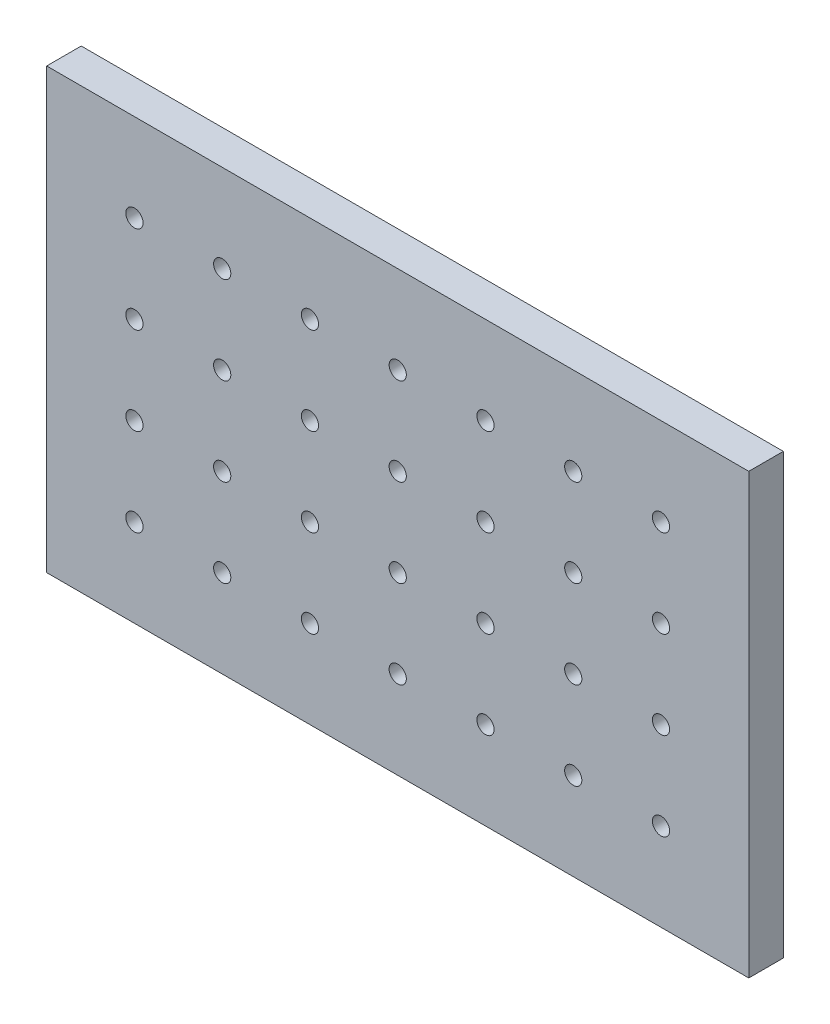
ISO-10303-21;
HEADER;
FILE_DESCRIPTION(('STEP AP214'),'2;1');
FILE_NAME('part.step','',(''),(''),'','','');
FILE_SCHEMA(('AUTOMOTIVE_DESIGN { 1 0 10303 214 1 1 1 1 }'));
ENDSEC;
DATA;
#1=APPLICATION_CONTEXT('core data for automotive mechanical design processes');
#2=APPLICATION_PROTOCOL_DEFINITION('international standard','automotive_design',2000,#1);
#3=PRODUCT_CONTEXT('',#1,'mechanical');
#4=PRODUCT('Part','Part','',(#3));
#5=PRODUCT_RELATED_PRODUCT_CATEGORY('part','',(#4));
#6=PRODUCT_DEFINITION_FORMATION('','',#4);
#7=PRODUCT_DEFINITION_CONTEXT('part definition',#1,'design');
#8=PRODUCT_DEFINITION('design','',#6,#7);
#9=PRODUCT_DEFINITION_SHAPE('','',#8);
#10=(LENGTH_UNIT() NAMED_UNIT(*) SI_UNIT(.MILLI.,.METRE.));
#11=(NAMED_UNIT(*) PLANE_ANGLE_UNIT() SI_UNIT($,.RADIAN.));
#12=(NAMED_UNIT(*) SI_UNIT($,.STERADIAN.) SOLID_ANGLE_UNIT());
#13=UNCERTAINTY_MEASURE_WITH_UNIT(LENGTH_MEASURE(1.E-05),#10,'distance_accuracy_value','');
#14=(GEOMETRIC_REPRESENTATION_CONTEXT(3) GLOBAL_UNCERTAINTY_ASSIGNED_CONTEXT((#13)) GLOBAL_UNIT_ASSIGNED_CONTEXT((#10,
#11,#12)) REPRESENTATION_CONTEXT('',''));
#15=CARTESIAN_POINT('',(0.,0.,0.));
#16=DIRECTION('',(0.,0.,1.));
#17=DIRECTION('',(1.,0.,0.));
#18=AXIS2_PLACEMENT_3D('',#15,#16,#17);
#19=CARTESIAN_POINT('',(0.,0.,10.));
#20=DIRECTION('',(-1.,0.,0.));
#21=DIRECTION('',(0.,-1.,0.));
#22=AXIS2_PLACEMENT_3D('',#19,#20,#21);
#23=PLANE('',#22);
#24=DIRECTION('',(0.,1.,0.));
#25=VECTOR('',#24,1.);
#26=CARTESIAN_POINT('',(0.,0.,0.));
#27=LINE('',#26,#25);
#28=CARTESIAN_POINT('',(0.,-127.,0.));
#29=VERTEX_POINT('',#28);
#30=CARTESIAN_POINT('',(0.,0.,0.));
#31=VERTEX_POINT('',#30);
#32=EDGE_CURVE('E97',#29,#31,#27,.T.);
#33=ORIENTED_EDGE('',*,*,#32,.T.);
#34=DIRECTION('',(0.,0.,-1.));
#35=VECTOR('',#34,1.);
#36=CARTESIAN_POINT('',(0.,0.,10.));
#37=LINE('',#36,#35);
#38=CARTESIAN_POINT('',(0.,0.,10.));
#39=VERTEX_POINT('',#38);
#40=EDGE_CURVE('E11',#39,#31,#37,.T.);
#41=ORIENTED_EDGE('',*,*,#40,.F.);
#42=DIRECTION('',(0.,1.,0.));
#43=VECTOR('',#42,1.);
#44=CARTESIAN_POINT('',(0.,0.,10.));
#45=LINE('',#44,#43);
#46=CARTESIAN_POINT('',(0.,-127.,10.));
#47=VERTEX_POINT('',#46);
#48=EDGE_CURVE('E85',#47,#39,#45,.T.);
#49=ORIENTED_EDGE('',*,*,#48,.F.);
#50=DIRECTION('',(0.,0.,-1.));
#51=VECTOR('',#50,1.);
#52=CARTESIAN_POINT('',(0.,-127.,10.));
#53=LINE('',#52,#51);
#54=EDGE_CURVE('E93',#47,#29,#53,.T.);
#55=ORIENTED_EDGE('',*,*,#54,.T.);
#56=EDGE_LOOP('',(#33,#41,#49,#55));
#57=FACE_BOUND('',#56,.T.);
#58=ADVANCED_FACE('F34',(#57),#23,.F.);
#59=CARTESIAN_POINT('',(0.,0.,10.));
#60=DIRECTION('',(0.,-1.,0.));
#61=DIRECTION('',(1.,0.,0.));
#62=AXIS2_PLACEMENT_3D('',#59,#60,#61);
#63=PLANE('',#62);
#64=DIRECTION('',(-1.,0.,0.));
#65=VECTOR('',#64,1.);
#66=CARTESIAN_POINT('',(0.,0.,0.));
#67=LINE('',#66,#65);
#68=CARTESIAN_POINT('',(-203.2,0.,0.));
#69=VERTEX_POINT('',#68);
#70=EDGE_CURVE('E89',#31,#69,#67,.T.);
#71=ORIENTED_EDGE('',*,*,#70,.T.);
#72=DIRECTION('',(0.,0.,-1.));
#73=VECTOR('',#72,1.);
#74=CARTESIAN_POINT('',(-203.2,0.,10.));
#75=LINE('',#74,#73);
#76=CARTESIAN_POINT('',(-203.2,0.,10.));
#77=VERTEX_POINT('',#76);
#78=EDGE_CURVE('E42',#77,#69,#75,.T.);
#79=ORIENTED_EDGE('',*,*,#78,.F.);
#80=DIRECTION('',(-1.,0.,0.));
#81=VECTOR('',#80,1.);
#82=CARTESIAN_POINT('',(0.,0.,10.));
#83=LINE('',#82,#81);
#84=EDGE_CURVE('E80',#39,#77,#83,.T.);
#85=ORIENTED_EDGE('',*,*,#84,.F.);
#86=ORIENTED_EDGE('',*,*,#40,.T.);
#87=EDGE_LOOP('',(#71,#79,#85,#86));
#88=FACE_BOUND('',#87,.T.);
#89=ADVANCED_FACE('F88',(#88),#63,.F.);
#90=CARTESIAN_POINT('',(-203.2,0.,10.));
#91=DIRECTION('',(1.,0.,0.));
#92=DIRECTION('',(0.,1.,0.));
#93=AXIS2_PLACEMENT_3D('',#90,#91,#92);
#94=PLANE('',#93);
#95=DIRECTION('',(0.,-1.,0.));
#96=VECTOR('',#95,1.);
#97=CARTESIAN_POINT('',(-203.2,0.,0.));
#98=LINE('',#97,#96);
#99=CARTESIAN_POINT('',(-203.2,-127.,0.));
#100=VERTEX_POINT('',#99);
#101=EDGE_CURVE('E67',#69,#100,#98,.T.);
#102=ORIENTED_EDGE('',*,*,#101,.T.);
#103=DIRECTION('',(0.,0.,-1.));
#104=VECTOR('',#103,1.);
#105=CARTESIAN_POINT('',(-203.2,-127.,10.));
#106=LINE('',#105,#104);
#107=CARTESIAN_POINT('',(-203.2,-127.,10.));
#108=VERTEX_POINT('',#107);
#109=EDGE_CURVE('E90',#108,#100,#106,.T.);
#110=ORIENTED_EDGE('',*,*,#109,.F.);
#111=DIRECTION('',(0.,-1.,0.));
#112=VECTOR('',#111,1.);
#113=CARTESIAN_POINT('',(-203.2,0.,10.));
#114=LINE('',#113,#112);
#115=EDGE_CURVE('E83',#77,#108,#114,.T.);
#116=ORIENTED_EDGE('',*,*,#115,.F.);
#117=ORIENTED_EDGE('',*,*,#78,.T.);
#118=EDGE_LOOP('',(#102,#110,#116,#117));
#119=FACE_BOUND('',#118,.T.);
#120=ADVANCED_FACE('F91',(#119),#94,.F.);
#121=CARTESIAN_POINT('',(0.,-127.,10.));
#122=DIRECTION('',(0.,1.,0.));
#123=DIRECTION('',(-1.,0.,0.));
#124=AXIS2_PLACEMENT_3D('',#121,#122,#123);
#125=PLANE('',#124);
#126=DIRECTION('',(1.,0.,0.));
#127=VECTOR('',#126,1.);
#128=CARTESIAN_POINT('',(0.,-127.,0.));
#129=LINE('',#128,#127);
#130=EDGE_CURVE('E73',#100,#29,#129,.T.);
#131=ORIENTED_EDGE('',*,*,#130,.T.);
#132=ORIENTED_EDGE('',*,*,#54,.F.);
#133=DIRECTION('',(1.,0.,0.));
#134=VECTOR('',#133,1.);
#135=CARTESIAN_POINT('',(0.,-127.,10.));
#136=LINE('',#135,#134);
#137=EDGE_CURVE('E50',#108,#47,#136,.T.);
#138=ORIENTED_EDGE('',*,*,#137,.F.);
#139=ORIENTED_EDGE('',*,*,#109,.T.);
#140=EDGE_LOOP('',(#131,#132,#138,#139));
#141=FACE_BOUND('',#140,.T.);
#142=ADVANCED_FACE('F105',(#141),#125,.F.);
#143=CARTESIAN_POINT('',(0.,0.,10.));
#144=DIRECTION('',(0.,0.,-1.));
#145=DIRECTION('',(-1.,0.,0.));
#146=AXIS2_PLACEMENT_3D('',#143,#144,#145);
#147=PLANE('',#146);
#148=CARTESIAN_POINT('',(-177.799999999999,-101.6,10.));
#149=DIRECTION('',(0.,0.,1.));
#150=DIRECTION('',(1.,0.,0.));
#151=AXIS2_PLACEMENT_3D('',#148,#149,#150);
#152=CIRCLE('',#151,2.48999999999999);
#153=CARTESIAN_POINT('',(-175.309999999999,-101.6,10.));
#154=VERTEX_POINT('',#153);
#155=EDGE_CURVE('E270',#154,#154,#152,.T.);
#156=ORIENTED_EDGE('',*,*,#155,.F.);
#157=EDGE_LOOP('',(#156));
#158=FACE_BOUND('',#157,.T.);
#159=CARTESIAN_POINT('',(-177.799999999999,-76.2,10.));
#160=DIRECTION('',(0.,0.,1.));
#161=DIRECTION('',(1.,0.,0.));
#162=AXIS2_PLACEMENT_3D('',#159,#160,#161);
#163=CIRCLE('',#162,2.48999999999999);
#164=CARTESIAN_POINT('',(-175.309999999999,-76.2,10.));
#165=VERTEX_POINT('',#164);
#166=EDGE_CURVE('E264',#165,#165,#163,.T.);
#167=ORIENTED_EDGE('',*,*,#166,.F.);
#168=EDGE_LOOP('',(#167));
#169=FACE_BOUND('',#168,.T.);
#170=CARTESIAN_POINT('',(-177.8,-50.8,10.));
#171=DIRECTION('',(0.,0.,1.));
#172=DIRECTION('',(1.,0.,0.));
#173=AXIS2_PLACEMENT_3D('',#170,#171,#172);
#174=CIRCLE('',#173,2.48999999999999);
#175=CARTESIAN_POINT('',(-175.31,-50.8,10.));
#176=VERTEX_POINT('',#175);
#177=EDGE_CURVE('E258',#176,#176,#174,.T.);
#178=ORIENTED_EDGE('',*,*,#177,.F.);
#179=EDGE_LOOP('',(#178));
#180=FACE_BOUND('',#179,.T.);
#181=CARTESIAN_POINT('',(-25.3999999999993,-101.6,10.));
#182=DIRECTION('',(0.,0.,1.));
#183=DIRECTION('',(1.,0.,0.));
#184=AXIS2_PLACEMENT_3D('',#181,#182,#183);
#185=CIRCLE('',#184,2.49);
#186=CARTESIAN_POINT('',(-22.9099999999993,-101.6,10.));
#187=VERTEX_POINT('',#186);
#188=EDGE_CURVE('E252',#187,#187,#185,.T.);
#189=ORIENTED_EDGE('',*,*,#188,.F.);
#190=EDGE_LOOP('',(#189));
#191=FACE_BOUND('',#190,.T.);
#192=CARTESIAN_POINT('',(-50.7999999999993,-101.6,10.));
#193=DIRECTION('',(0.,0.,1.));
#194=DIRECTION('',(1.,0.,0.));
#195=AXIS2_PLACEMENT_3D('',#192,#193,#194);
#196=CIRCLE('',#195,2.49);
#197=CARTESIAN_POINT('',(-48.3099999999993,-101.6,10.));
#198=VERTEX_POINT('',#197);
#199=EDGE_CURVE('E246',#198,#198,#196,.T.);
#200=ORIENTED_EDGE('',*,*,#199,.F.);
#201=EDGE_LOOP('',(#200));
#202=FACE_BOUND('',#201,.T.);
#203=CARTESIAN_POINT('',(-76.1999999999993,-101.6,10.));
#204=DIRECTION('',(0.,0.,1.));
#205=DIRECTION('',(1.,0.,0.));
#206=AXIS2_PLACEMENT_3D('',#203,#204,#205);
#207=CIRCLE('',#206,2.49000000000001);
#208=CARTESIAN_POINT('',(-73.7099999999993,-101.6,10.));
#209=VERTEX_POINT('',#208);
#210=EDGE_CURVE('E240',#209,#209,#207,.T.);
#211=ORIENTED_EDGE('',*,*,#210,.F.);
#212=EDGE_LOOP('',(#211));
#213=FACE_BOUND('',#212,.T.);
#214=CARTESIAN_POINT('',(-101.599999999999,-101.6,10.));
#215=DIRECTION('',(0.,0.,1.));
#216=DIRECTION('',(1.,0.,0.));
#217=AXIS2_PLACEMENT_3D('',#214,#215,#216);
#218=CIRCLE('',#217,2.49000000000001);
#219=CARTESIAN_POINT('',(-99.1099999999993,-101.6,10.));
#220=VERTEX_POINT('',#219);
#221=EDGE_CURVE('E234',#220,#220,#218,.T.);
#222=ORIENTED_EDGE('',*,*,#221,.F.);
#223=EDGE_LOOP('',(#222));
#224=FACE_BOUND('',#223,.T.);
#225=CARTESIAN_POINT('',(-126.999999999999,-101.6,10.));
#226=DIRECTION('',(0.,0.,1.));
#227=DIRECTION('',(1.,0.,0.));
#228=AXIS2_PLACEMENT_3D('',#225,#226,#227);
#229=CIRCLE('',#228,2.49000000000001);
#230=CARTESIAN_POINT('',(-124.509999999999,-101.6,10.));
#231=VERTEX_POINT('',#230);
#232=EDGE_CURVE('E228',#231,#231,#229,.T.);
#233=ORIENTED_EDGE('',*,*,#232,.F.);
#234=EDGE_LOOP('',(#233));
#235=FACE_BOUND('',#234,.T.);
#236=CARTESIAN_POINT('',(-152.399999999999,-101.6,10.));
#237=DIRECTION('',(0.,0.,1.));
#238=DIRECTION('',(1.,0.,0.));
#239=AXIS2_PLACEMENT_3D('',#236,#237,#238);
#240=CIRCLE('',#239,2.48999999999999);
#241=CARTESIAN_POINT('',(-149.909999999999,-101.6,10.));
#242=VERTEX_POINT('',#241);
#243=EDGE_CURVE('E222',#242,#242,#240,.T.);
#244=ORIENTED_EDGE('',*,*,#243,.F.);
#245=EDGE_LOOP('',(#244));
#246=FACE_BOUND('',#245,.T.);
#247=CARTESIAN_POINT('',(-25.3999999999996,-76.2,10.));
#248=DIRECTION('',(0.,0.,1.));
#249=DIRECTION('',(1.,0.,0.));
#250=AXIS2_PLACEMENT_3D('',#247,#248,#249);
#251=CIRCLE('',#250,2.49);
#252=CARTESIAN_POINT('',(-22.9099999999996,-76.2,10.));
#253=VERTEX_POINT('',#252);
#254=EDGE_CURVE('E216',#253,#253,#251,.T.);
#255=ORIENTED_EDGE('',*,*,#254,.F.);
#256=EDGE_LOOP('',(#255));
#257=FACE_BOUND('',#256,.T.);
#258=CARTESIAN_POINT('',(-50.7999999999996,-76.2,10.));
#259=DIRECTION('',(0.,0.,1.));
#260=DIRECTION('',(1.,0.,0.));
#261=AXIS2_PLACEMENT_3D('',#258,#259,#260);
#262=CIRCLE('',#261,2.49);
#263=CARTESIAN_POINT('',(-48.3099999999996,-76.2,10.));
#264=VERTEX_POINT('',#263);
#265=EDGE_CURVE('E210',#264,#264,#262,.T.);
#266=ORIENTED_EDGE('',*,*,#265,.F.);
#267=EDGE_LOOP('',(#266));
#268=FACE_BOUND('',#267,.T.);
#269=CARTESIAN_POINT('',(-76.1999999999996,-76.2,10.));
#270=DIRECTION('',(0.,0.,1.));
#271=DIRECTION('',(1.,0.,0.));
#272=AXIS2_PLACEMENT_3D('',#269,#270,#271);
#273=CIRCLE('',#272,2.49000000000001);
#274=CARTESIAN_POINT('',(-73.7099999999996,-76.2,10.));
#275=VERTEX_POINT('',#274);
#276=EDGE_CURVE('E204',#275,#275,#273,.T.);
#277=ORIENTED_EDGE('',*,*,#276,.F.);
#278=EDGE_LOOP('',(#277));
#279=FACE_BOUND('',#278,.T.);
#280=CARTESIAN_POINT('',(-101.6,-76.2,10.));
#281=DIRECTION('',(0.,0.,1.));
#282=DIRECTION('',(1.,0.,0.));
#283=AXIS2_PLACEMENT_3D('',#280,#281,#282);
#284=CIRCLE('',#283,2.49000000000001);
#285=CARTESIAN_POINT('',(-99.1099999999995,-76.2,10.));
#286=VERTEX_POINT('',#285);
#287=EDGE_CURVE('E198',#286,#286,#284,.T.);
#288=ORIENTED_EDGE('',*,*,#287,.F.);
#289=EDGE_LOOP('',(#288));
#290=FACE_BOUND('',#289,.T.);
#291=CARTESIAN_POINT('',(-127.,-76.2,10.));
#292=DIRECTION('',(0.,0.,1.));
#293=DIRECTION('',(1.,0.,0.));
#294=AXIS2_PLACEMENT_3D('',#291,#292,#293);
#295=CIRCLE('',#294,2.49000000000001);
#296=CARTESIAN_POINT('',(-124.509999999999,-76.2,10.));
#297=VERTEX_POINT('',#296);
#298=EDGE_CURVE('E192',#297,#297,#295,.T.);
#299=ORIENTED_EDGE('',*,*,#298,.F.);
#300=EDGE_LOOP('',(#299));
#301=FACE_BOUND('',#300,.T.);
#302=CARTESIAN_POINT('',(-152.399999999999,-76.2,10.));
#303=DIRECTION('',(0.,0.,1.));
#304=DIRECTION('',(1.,0.,0.));
#305=AXIS2_PLACEMENT_3D('',#302,#303,#304);
#306=CIRCLE('',#305,2.48999999999999);
#307=CARTESIAN_POINT('',(-149.909999999999,-76.2,10.));
#308=VERTEX_POINT('',#307);
#309=EDGE_CURVE('E186',#308,#308,#306,.T.);
#310=ORIENTED_EDGE('',*,*,#309,.F.);
#311=EDGE_LOOP('',(#310));
#312=FACE_BOUND('',#311,.T.);
#313=CARTESIAN_POINT('',(-25.3999999999999,-50.8,10.));
#314=DIRECTION('',(0.,0.,1.));
#315=DIRECTION('',(1.,0.,0.));
#316=AXIS2_PLACEMENT_3D('',#313,#314,#315);
#317=CIRCLE('',#316,2.49);
#318=CARTESIAN_POINT('',(-22.9099999999999,-50.8,10.));
#319=VERTEX_POINT('',#318);
#320=EDGE_CURVE('E180',#319,#319,#317,.T.);
#321=ORIENTED_EDGE('',*,*,#320,.F.);
#322=EDGE_LOOP('',(#321));
#323=FACE_BOUND('',#322,.T.);
#324=CARTESIAN_POINT('',(-50.7999999999998,-50.8,10.));
#325=DIRECTION('',(0.,0.,1.));
#326=DIRECTION('',(1.,0.,0.));
#327=AXIS2_PLACEMENT_3D('',#324,#325,#326);
#328=CIRCLE('',#327,2.49);
#329=CARTESIAN_POINT('',(-48.3099999999998,-50.8,10.));
#330=VERTEX_POINT('',#329);
#331=EDGE_CURVE('E174',#330,#330,#328,.T.);
#332=ORIENTED_EDGE('',*,*,#331,.F.);
#333=EDGE_LOOP('',(#332));
#334=FACE_BOUND('',#333,.T.);
#335=CARTESIAN_POINT('',(-76.1999999999998,-50.8,10.));
#336=DIRECTION('',(0.,0.,1.));
#337=DIRECTION('',(1.,0.,0.));
#338=AXIS2_PLACEMENT_3D('',#335,#336,#337);
#339=CIRCLE('',#338,2.49000000000001);
#340=CARTESIAN_POINT('',(-73.7099999999998,-50.8,10.));
#341=VERTEX_POINT('',#340);
#342=EDGE_CURVE('E168',#341,#341,#339,.T.);
#343=ORIENTED_EDGE('',*,*,#342,.F.);
#344=EDGE_LOOP('',(#343));
#345=FACE_BOUND('',#344,.T.);
#346=CARTESIAN_POINT('',(-101.6,-50.8,10.));
#347=DIRECTION('',(0.,0.,1.));
#348=DIRECTION('',(1.,0.,0.));
#349=AXIS2_PLACEMENT_3D('',#346,#347,#348);
#350=CIRCLE('',#349,2.49000000000001);
#351=CARTESIAN_POINT('',(-99.1099999999998,-50.8,10.));
#352=VERTEX_POINT('',#351);
#353=EDGE_CURVE('E162',#352,#352,#350,.T.);
#354=ORIENTED_EDGE('',*,*,#353,.F.);
#355=EDGE_LOOP('',(#354));
#356=FACE_BOUND('',#355,.T.);
#357=CARTESIAN_POINT('',(-127.,-50.8,10.));
#358=DIRECTION('',(0.,0.,1.));
#359=DIRECTION('',(1.,0.,0.));
#360=AXIS2_PLACEMENT_3D('',#357,#358,#359);
#361=CIRCLE('',#360,2.49000000000001);
#362=CARTESIAN_POINT('',(-124.51,-50.8,10.));
#363=VERTEX_POINT('',#362);
#364=EDGE_CURVE('E156',#363,#363,#361,.T.);
#365=ORIENTED_EDGE('',*,*,#364,.F.);
#366=EDGE_LOOP('',(#365));
#367=FACE_BOUND('',#366,.T.);
#368=CARTESIAN_POINT('',(-152.4,-50.8,10.));
#369=DIRECTION('',(0.,0.,1.));
#370=DIRECTION('',(1.,0.,0.));
#371=AXIS2_PLACEMENT_3D('',#368,#369,#370);
#372=CIRCLE('',#371,2.48999999999999);
#373=CARTESIAN_POINT('',(-149.91,-50.8,10.));
#374=VERTEX_POINT('',#373);
#375=EDGE_CURVE('E150',#374,#374,#372,.T.);
#376=ORIENTED_EDGE('',*,*,#375,.F.);
#377=EDGE_LOOP('',(#376));
#378=FACE_BOUND('',#377,.T.);
#379=CARTESIAN_POINT('',(-25.4000000000001,-25.4,10.));
#380=DIRECTION('',(0.,0.,1.));
#381=DIRECTION('',(1.,0.,0.));
#382=AXIS2_PLACEMENT_3D('',#379,#380,#381);
#383=CIRCLE('',#382,2.49);
#384=CARTESIAN_POINT('',(-22.9100000000001,-25.4,10.));
#385=VERTEX_POINT('',#384);
#386=EDGE_CURVE('E144',#385,#385,#383,.T.);
#387=ORIENTED_EDGE('',*,*,#386,.F.);
#388=EDGE_LOOP('',(#387));
#389=FACE_BOUND('',#388,.T.);
#390=CARTESIAN_POINT('',(-50.8000000000001,-25.4,10.));
#391=DIRECTION('',(0.,0.,1.));
#392=DIRECTION('',(1.,0.,0.));
#393=AXIS2_PLACEMENT_3D('',#390,#391,#392);
#394=CIRCLE('',#393,2.49);
#395=CARTESIAN_POINT('',(-48.3100000000001,-25.4,10.));
#396=VERTEX_POINT('',#395);
#397=EDGE_CURVE('E138',#396,#396,#394,.T.);
#398=ORIENTED_EDGE('',*,*,#397,.F.);
#399=EDGE_LOOP('',(#398));
#400=FACE_BOUND('',#399,.T.);
#401=CARTESIAN_POINT('',(-76.2000000000001,-25.4,10.));
#402=DIRECTION('',(0.,0.,1.));
#403=DIRECTION('',(1.,0.,0.));
#404=AXIS2_PLACEMENT_3D('',#401,#402,#403);
#405=CIRCLE('',#404,2.49000000000001);
#406=CARTESIAN_POINT('',(-73.7100000000001,-25.4,10.));
#407=VERTEX_POINT('',#406);
#408=EDGE_CURVE('E132',#407,#407,#405,.T.);
#409=ORIENTED_EDGE('',*,*,#408,.F.);
#410=EDGE_LOOP('',(#409));
#411=FACE_BOUND('',#410,.T.);
#412=CARTESIAN_POINT('',(-101.6,-25.4,10.));
#413=DIRECTION('',(0.,0.,1.));
#414=DIRECTION('',(1.,0.,0.));
#415=AXIS2_PLACEMENT_3D('',#412,#413,#414);
#416=CIRCLE('',#415,2.49000000000001);
#417=CARTESIAN_POINT('',(-99.1100000000001,-25.4,10.));
#418=VERTEX_POINT('',#417);
#419=EDGE_CURVE('E126',#418,#418,#416,.T.);
#420=ORIENTED_EDGE('',*,*,#419,.F.);
#421=EDGE_LOOP('',(#420));
#422=FACE_BOUND('',#421,.T.);
#423=CARTESIAN_POINT('',(-127.,-25.4,10.));
#424=DIRECTION('',(0.,0.,1.));
#425=DIRECTION('',(1.,0.,0.));
#426=AXIS2_PLACEMENT_3D('',#423,#424,#425);
#427=CIRCLE('',#426,2.49000000000001);
#428=CARTESIAN_POINT('',(-124.51,-25.4,10.));
#429=VERTEX_POINT('',#428);
#430=EDGE_CURVE('E120',#429,#429,#427,.T.);
#431=ORIENTED_EDGE('',*,*,#430,.F.);
#432=EDGE_LOOP('',(#431));
#433=FACE_BOUND('',#432,.T.);
#434=CARTESIAN_POINT('',(-152.4,-25.4,10.));
#435=DIRECTION('',(0.,0.,1.));
#436=DIRECTION('',(1.,0.,0.));
#437=AXIS2_PLACEMENT_3D('',#434,#435,#436);
#438=CIRCLE('',#437,2.48999999999998);
#439=CARTESIAN_POINT('',(-149.91,-25.4,10.));
#440=VERTEX_POINT('',#439);
#441=EDGE_CURVE('E114',#440,#440,#438,.T.);
#442=ORIENTED_EDGE('',*,*,#441,.F.);
#443=EDGE_LOOP('',(#442));
#444=FACE_BOUND('',#443,.T.);
#445=CARTESIAN_POINT('',(-177.8,-25.4,10.));
#446=DIRECTION('',(0.,0.,1.));
#447=DIRECTION('',(1.,0.,0.));
#448=AXIS2_PLACEMENT_3D('',#445,#446,#447);
#449=CIRCLE('',#448,2.48999999999998);
#450=CARTESIAN_POINT('',(-175.31,-25.4,10.));
#451=VERTEX_POINT('',#450);
#452=EDGE_CURVE('E100',#451,#451,#449,.T.);
#453=ORIENTED_EDGE('',*,*,#452,.F.);
#454=EDGE_LOOP('',(#453));
#455=FACE_BOUND('',#454,.T.);
#456=ORIENTED_EDGE('',*,*,#48,.T.);
#457=ORIENTED_EDGE('',*,*,#84,.T.);
#458=ORIENTED_EDGE('',*,*,#115,.T.);
#459=ORIENTED_EDGE('',*,*,#137,.T.);
#460=EDGE_LOOP('',(#456,#457,#458,#459));
#461=FACE_BOUND('',#460,.T.);
#462=ADVANCED_FACE('F81',(#158,#169,#180,#191,#202,#213,#224,#235,#246,#257,#268,#279,#290,#301,
#312,#323,#334,#345,#356,#367,#378,#389,#400,#411,#422,#433,#444,#455,#461),#147,.F.);
#463=CARTESIAN_POINT('',(0.,0.,0.));
#464=DIRECTION('',(0.,0.,-1.));
#465=DIRECTION('',(-1.,0.,0.));
#466=AXIS2_PLACEMENT_3D('',#463,#464,#465);
#467=PLANE('',#466);
#468=CARTESIAN_POINT('',(-177.799999999999,-101.6,0.));
#469=DIRECTION('',(0.,0.,-1.));
#470=DIRECTION('',(-1.,0.,0.));
#471=AXIS2_PLACEMENT_3D('',#468,#469,#470);
#472=CIRCLE('',#471,2.48999999999999);
#473=CARTESIAN_POINT('',(-180.289999999999,-101.6,0.));
#474=VERTEX_POINT('',#473);
#475=EDGE_CURVE('E273',#474,#474,#472,.F.);
#476=ORIENTED_EDGE('',*,*,#475,.T.);
#477=EDGE_LOOP('',(#476));
#478=FACE_BOUND('',#477,.T.);
#479=CARTESIAN_POINT('',(-177.799999999999,-76.2,0.));
#480=DIRECTION('',(0.,0.,-1.));
#481=DIRECTION('',(-1.,0.,0.));
#482=AXIS2_PLACEMENT_3D('',#479,#480,#481);
#483=CIRCLE('',#482,2.48999999999999);
#484=CARTESIAN_POINT('',(-180.289999999999,-76.2,0.));
#485=VERTEX_POINT('',#484);
#486=EDGE_CURVE('E267',#485,#485,#483,.F.);
#487=ORIENTED_EDGE('',*,*,#486,.T.);
#488=EDGE_LOOP('',(#487));
#489=FACE_BOUND('',#488,.T.);
#490=CARTESIAN_POINT('',(-177.8,-50.8,0.));
#491=DIRECTION('',(0.,0.,-1.));
#492=DIRECTION('',(-1.,0.,0.));
#493=AXIS2_PLACEMENT_3D('',#490,#491,#492);
#494=CIRCLE('',#493,2.48999999999999);
#495=CARTESIAN_POINT('',(-180.29,-50.8,0.));
#496=VERTEX_POINT('',#495);
#497=EDGE_CURVE('E261',#496,#496,#494,.F.);
#498=ORIENTED_EDGE('',*,*,#497,.T.);
#499=EDGE_LOOP('',(#498));
#500=FACE_BOUND('',#499,.T.);
#501=CARTESIAN_POINT('',(-25.3999999999993,-101.6,0.));
#502=DIRECTION('',(0.,0.,-1.));
#503=DIRECTION('',(-1.,0.,0.));
#504=AXIS2_PLACEMENT_3D('',#501,#502,#503);
#505=CIRCLE('',#504,2.49);
#506=CARTESIAN_POINT('',(-27.8899999999993,-101.6,0.));
#507=VERTEX_POINT('',#506);
#508=EDGE_CURVE('E255',#507,#507,#505,.F.);
#509=ORIENTED_EDGE('',*,*,#508,.T.);
#510=EDGE_LOOP('',(#509));
#511=FACE_BOUND('',#510,.T.);
#512=CARTESIAN_POINT('',(-50.7999999999993,-101.6,0.));
#513=DIRECTION('',(0.,0.,-1.));
#514=DIRECTION('',(-1.,0.,0.));
#515=AXIS2_PLACEMENT_3D('',#512,#513,#514);
#516=CIRCLE('',#515,2.49);
#517=CARTESIAN_POINT('',(-53.2899999999993,-101.6,0.));
#518=VERTEX_POINT('',#517);
#519=EDGE_CURVE('E249',#518,#518,#516,.F.);
#520=ORIENTED_EDGE('',*,*,#519,.T.);
#521=EDGE_LOOP('',(#520));
#522=FACE_BOUND('',#521,.T.);
#523=CARTESIAN_POINT('',(-76.1999999999993,-101.6,0.));
#524=DIRECTION('',(0.,0.,-1.));
#525=DIRECTION('',(-1.,0.,0.));
#526=AXIS2_PLACEMENT_3D('',#523,#524,#525);
#527=CIRCLE('',#526,2.49000000000001);
#528=CARTESIAN_POINT('',(-78.6899999999993,-101.6,0.));
#529=VERTEX_POINT('',#528);
#530=EDGE_CURVE('E243',#529,#529,#527,.F.);
#531=ORIENTED_EDGE('',*,*,#530,.T.);
#532=EDGE_LOOP('',(#531));
#533=FACE_BOUND('',#532,.T.);
#534=CARTESIAN_POINT('',(-101.599999999999,-101.6,0.));
#535=DIRECTION('',(0.,0.,-1.));
#536=DIRECTION('',(-1.,0.,0.));
#537=AXIS2_PLACEMENT_3D('',#534,#535,#536);
#538=CIRCLE('',#537,2.49000000000001);
#539=CARTESIAN_POINT('',(-104.089999999999,-101.6,0.));
#540=VERTEX_POINT('',#539);
#541=EDGE_CURVE('E237',#540,#540,#538,.F.);
#542=ORIENTED_EDGE('',*,*,#541,.T.);
#543=EDGE_LOOP('',(#542));
#544=FACE_BOUND('',#543,.T.);
#545=CARTESIAN_POINT('',(-126.999999999999,-101.6,0.));
#546=DIRECTION('',(0.,0.,-1.));
#547=DIRECTION('',(-1.,0.,0.));
#548=AXIS2_PLACEMENT_3D('',#545,#546,#547);
#549=CIRCLE('',#548,2.49000000000001);
#550=CARTESIAN_POINT('',(-129.489999999999,-101.6,0.));
#551=VERTEX_POINT('',#550);
#552=EDGE_CURVE('E231',#551,#551,#549,.F.);
#553=ORIENTED_EDGE('',*,*,#552,.T.);
#554=EDGE_LOOP('',(#553));
#555=FACE_BOUND('',#554,.T.);
#556=CARTESIAN_POINT('',(-152.399999999999,-101.6,0.));
#557=DIRECTION('',(0.,0.,-1.));
#558=DIRECTION('',(-1.,0.,0.));
#559=AXIS2_PLACEMENT_3D('',#556,#557,#558);
#560=CIRCLE('',#559,2.48999999999999);
#561=CARTESIAN_POINT('',(-154.889999999999,-101.6,0.));
#562=VERTEX_POINT('',#561);
#563=EDGE_CURVE('E225',#562,#562,#560,.F.);
#564=ORIENTED_EDGE('',*,*,#563,.T.);
#565=EDGE_LOOP('',(#564));
#566=FACE_BOUND('',#565,.T.);
#567=CARTESIAN_POINT('',(-25.3999999999996,-76.2,0.));
#568=DIRECTION('',(0.,0.,-1.));
#569=DIRECTION('',(-1.,0.,0.));
#570=AXIS2_PLACEMENT_3D('',#567,#568,#569);
#571=CIRCLE('',#570,2.49);
#572=CARTESIAN_POINT('',(-27.8899999999996,-76.2,0.));
#573=VERTEX_POINT('',#572);
#574=EDGE_CURVE('E219',#573,#573,#571,.F.);
#575=ORIENTED_EDGE('',*,*,#574,.T.);
#576=EDGE_LOOP('',(#575));
#577=FACE_BOUND('',#576,.T.);
#578=CARTESIAN_POINT('',(-50.7999999999996,-76.2,0.));
#579=DIRECTION('',(0.,0.,-1.));
#580=DIRECTION('',(-1.,0.,0.));
#581=AXIS2_PLACEMENT_3D('',#578,#579,#580);
#582=CIRCLE('',#581,2.49);
#583=CARTESIAN_POINT('',(-53.2899999999996,-76.2,0.));
#584=VERTEX_POINT('',#583);
#585=EDGE_CURVE('E213',#584,#584,#582,.F.);
#586=ORIENTED_EDGE('',*,*,#585,.T.);
#587=EDGE_LOOP('',(#586));
#588=FACE_BOUND('',#587,.T.);
#589=CARTESIAN_POINT('',(-76.1999999999996,-76.2,0.));
#590=DIRECTION('',(0.,0.,-1.));
#591=DIRECTION('',(-1.,0.,0.));
#592=AXIS2_PLACEMENT_3D('',#589,#590,#591);
#593=CIRCLE('',#592,2.49000000000001);
#594=CARTESIAN_POINT('',(-78.6899999999996,-76.2,0.));
#595=VERTEX_POINT('',#594);
#596=EDGE_CURVE('E207',#595,#595,#593,.F.);
#597=ORIENTED_EDGE('',*,*,#596,.T.);
#598=EDGE_LOOP('',(#597));
#599=FACE_BOUND('',#598,.T.);
#600=CARTESIAN_POINT('',(-101.6,-76.2,0.));
#601=DIRECTION('',(0.,0.,-1.));
#602=DIRECTION('',(-1.,0.,0.));
#603=AXIS2_PLACEMENT_3D('',#600,#601,#602);
#604=CIRCLE('',#603,2.49000000000001);
#605=CARTESIAN_POINT('',(-104.09,-76.2,0.));
#606=VERTEX_POINT('',#605);
#607=EDGE_CURVE('E201',#606,#606,#604,.F.);
#608=ORIENTED_EDGE('',*,*,#607,.T.);
#609=EDGE_LOOP('',(#608));
#610=FACE_BOUND('',#609,.T.);
#611=CARTESIAN_POINT('',(-127.,-76.2,0.));
#612=DIRECTION('',(0.,0.,-1.));
#613=DIRECTION('',(-1.,0.,0.));
#614=AXIS2_PLACEMENT_3D('',#611,#612,#613);
#615=CIRCLE('',#614,2.49000000000001);
#616=CARTESIAN_POINT('',(-129.49,-76.2,0.));
#617=VERTEX_POINT('',#616);
#618=EDGE_CURVE('E195',#617,#617,#615,.F.);
#619=ORIENTED_EDGE('',*,*,#618,.T.);
#620=EDGE_LOOP('',(#619));
#621=FACE_BOUND('',#620,.T.);
#622=CARTESIAN_POINT('',(-152.399999999999,-76.2,0.));
#623=DIRECTION('',(0.,0.,-1.));
#624=DIRECTION('',(-1.,0.,0.));
#625=AXIS2_PLACEMENT_3D('',#622,#623,#624);
#626=CIRCLE('',#625,2.48999999999999);
#627=CARTESIAN_POINT('',(-154.889999999999,-76.2,0.));
#628=VERTEX_POINT('',#627);
#629=EDGE_CURVE('E189',#628,#628,#626,.F.);
#630=ORIENTED_EDGE('',*,*,#629,.T.);
#631=EDGE_LOOP('',(#630));
#632=FACE_BOUND('',#631,.T.);
#633=CARTESIAN_POINT('',(-25.3999999999999,-50.8,0.));
#634=DIRECTION('',(0.,0.,-1.));
#635=DIRECTION('',(-1.,0.,0.));
#636=AXIS2_PLACEMENT_3D('',#633,#634,#635);
#637=CIRCLE('',#636,2.49);
#638=CARTESIAN_POINT('',(-27.8899999999999,-50.8,0.));
#639=VERTEX_POINT('',#638);
#640=EDGE_CURVE('E183',#639,#639,#637,.F.);
#641=ORIENTED_EDGE('',*,*,#640,.T.);
#642=EDGE_LOOP('',(#641));
#643=FACE_BOUND('',#642,.T.);
#644=CARTESIAN_POINT('',(-50.7999999999998,-50.8,0.));
#645=DIRECTION('',(0.,0.,-1.));
#646=DIRECTION('',(-1.,0.,0.));
#647=AXIS2_PLACEMENT_3D('',#644,#645,#646);
#648=CIRCLE('',#647,2.49);
#649=CARTESIAN_POINT('',(-53.2899999999998,-50.8,0.));
#650=VERTEX_POINT('',#649);
#651=EDGE_CURVE('E177',#650,#650,#648,.F.);
#652=ORIENTED_EDGE('',*,*,#651,.T.);
#653=EDGE_LOOP('',(#652));
#654=FACE_BOUND('',#653,.T.);
#655=CARTESIAN_POINT('',(-76.1999999999998,-50.8,0.));
#656=DIRECTION('',(0.,0.,-1.));
#657=DIRECTION('',(-1.,0.,0.));
#658=AXIS2_PLACEMENT_3D('',#655,#656,#657);
#659=CIRCLE('',#658,2.49000000000001);
#660=CARTESIAN_POINT('',(-78.6899999999998,-50.8,0.));
#661=VERTEX_POINT('',#660);
#662=EDGE_CURVE('E171',#661,#661,#659,.F.);
#663=ORIENTED_EDGE('',*,*,#662,.T.);
#664=EDGE_LOOP('',(#663));
#665=FACE_BOUND('',#664,.T.);
#666=CARTESIAN_POINT('',(-101.6,-50.8,0.));
#667=DIRECTION('',(0.,0.,-1.));
#668=DIRECTION('',(-1.,0.,0.));
#669=AXIS2_PLACEMENT_3D('',#666,#667,#668);
#670=CIRCLE('',#669,2.49000000000001);
#671=CARTESIAN_POINT('',(-104.09,-50.8,0.));
#672=VERTEX_POINT('',#671);
#673=EDGE_CURVE('E165',#672,#672,#670,.F.);
#674=ORIENTED_EDGE('',*,*,#673,.T.);
#675=EDGE_LOOP('',(#674));
#676=FACE_BOUND('',#675,.T.);
#677=CARTESIAN_POINT('',(-127.,-50.8,0.));
#678=DIRECTION('',(0.,0.,-1.));
#679=DIRECTION('',(-1.,0.,0.));
#680=AXIS2_PLACEMENT_3D('',#677,#678,#679);
#681=CIRCLE('',#680,2.49000000000001);
#682=CARTESIAN_POINT('',(-129.49,-50.8,0.));
#683=VERTEX_POINT('',#682);
#684=EDGE_CURVE('E159',#683,#683,#681,.F.);
#685=ORIENTED_EDGE('',*,*,#684,.T.);
#686=EDGE_LOOP('',(#685));
#687=FACE_BOUND('',#686,.T.);
#688=CARTESIAN_POINT('',(-152.4,-50.8,0.));
#689=DIRECTION('',(0.,0.,-1.));
#690=DIRECTION('',(-1.,0.,0.));
#691=AXIS2_PLACEMENT_3D('',#688,#689,#690);
#692=CIRCLE('',#691,2.48999999999999);
#693=CARTESIAN_POINT('',(-154.89,-50.8,0.));
#694=VERTEX_POINT('',#693);
#695=EDGE_CURVE('E153',#694,#694,#692,.F.);
#696=ORIENTED_EDGE('',*,*,#695,.T.);
#697=EDGE_LOOP('',(#696));
#698=FACE_BOUND('',#697,.T.);
#699=CARTESIAN_POINT('',(-25.4000000000001,-25.4,0.));
#700=DIRECTION('',(0.,0.,-1.));
#701=DIRECTION('',(-1.,0.,0.));
#702=AXIS2_PLACEMENT_3D('',#699,#700,#701);
#703=CIRCLE('',#702,2.49);
#704=CARTESIAN_POINT('',(-27.8900000000001,-25.4,0.));
#705=VERTEX_POINT('',#704);
#706=EDGE_CURVE('E147',#705,#705,#703,.F.);
#707=ORIENTED_EDGE('',*,*,#706,.T.);
#708=EDGE_LOOP('',(#707));
#709=FACE_BOUND('',#708,.T.);
#710=CARTESIAN_POINT('',(-50.8000000000001,-25.4,0.));
#711=DIRECTION('',(0.,0.,-1.));
#712=DIRECTION('',(-1.,0.,0.));
#713=AXIS2_PLACEMENT_3D('',#710,#711,#712);
#714=CIRCLE('',#713,2.49);
#715=CARTESIAN_POINT('',(-53.2900000000001,-25.4,0.));
#716=VERTEX_POINT('',#715);
#717=EDGE_CURVE('E141',#716,#716,#714,.F.);
#718=ORIENTED_EDGE('',*,*,#717,.T.);
#719=EDGE_LOOP('',(#718));
#720=FACE_BOUND('',#719,.T.);
#721=CARTESIAN_POINT('',(-76.2000000000001,-25.4,0.));
#722=DIRECTION('',(0.,0.,-1.));
#723=DIRECTION('',(-1.,0.,0.));
#724=AXIS2_PLACEMENT_3D('',#721,#722,#723);
#725=CIRCLE('',#724,2.49000000000001);
#726=CARTESIAN_POINT('',(-78.6900000000001,-25.4,0.));
#727=VERTEX_POINT('',#726);
#728=EDGE_CURVE('E135',#727,#727,#725,.F.);
#729=ORIENTED_EDGE('',*,*,#728,.T.);
#730=EDGE_LOOP('',(#729));
#731=FACE_BOUND('',#730,.T.);
#732=CARTESIAN_POINT('',(-101.6,-25.4,0.));
#733=DIRECTION('',(0.,0.,-1.));
#734=DIRECTION('',(-1.,0.,0.));
#735=AXIS2_PLACEMENT_3D('',#732,#733,#734);
#736=CIRCLE('',#735,2.49000000000001);
#737=CARTESIAN_POINT('',(-104.09,-25.4,0.));
#738=VERTEX_POINT('',#737);
#739=EDGE_CURVE('E129',#738,#738,#736,.F.);
#740=ORIENTED_EDGE('',*,*,#739,.T.);
#741=EDGE_LOOP('',(#740));
#742=FACE_BOUND('',#741,.T.);
#743=CARTESIAN_POINT('',(-127.,-25.4,0.));
#744=DIRECTION('',(0.,0.,-1.));
#745=DIRECTION('',(-1.,0.,0.));
#746=AXIS2_PLACEMENT_3D('',#743,#744,#745);
#747=CIRCLE('',#746,2.49000000000001);
#748=CARTESIAN_POINT('',(-129.49,-25.4,0.));
#749=VERTEX_POINT('',#748);
#750=EDGE_CURVE('E123',#749,#749,#747,.F.);
#751=ORIENTED_EDGE('',*,*,#750,.T.);
#752=EDGE_LOOP('',(#751));
#753=FACE_BOUND('',#752,.T.);
#754=CARTESIAN_POINT('',(-152.4,-25.4,0.));
#755=DIRECTION('',(0.,0.,-1.));
#756=DIRECTION('',(-1.,0.,0.));
#757=AXIS2_PLACEMENT_3D('',#754,#755,#756);
#758=CIRCLE('',#757,2.48999999999998);
#759=CARTESIAN_POINT('',(-154.89,-25.4,0.));
#760=VERTEX_POINT('',#759);
#761=EDGE_CURVE('E117',#760,#760,#758,.F.);
#762=ORIENTED_EDGE('',*,*,#761,.T.);
#763=EDGE_LOOP('',(#762));
#764=FACE_BOUND('',#763,.T.);
#765=CARTESIAN_POINT('',(-177.8,-25.4,0.));
#766=DIRECTION('',(0.,0.,-1.));
#767=DIRECTION('',(-1.,0.,0.));
#768=AXIS2_PLACEMENT_3D('',#765,#766,#767);
#769=CIRCLE('',#768,2.48999999999998);
#770=CARTESIAN_POINT('',(-180.29,-25.4,0.));
#771=VERTEX_POINT('',#770);
#772=EDGE_CURVE('E111',#771,#771,#769,.F.);
#773=ORIENTED_EDGE('',*,*,#772,.T.);
#774=EDGE_LOOP('',(#773));
#775=FACE_BOUND('',#774,.T.);
#776=ORIENTED_EDGE('',*,*,#32,.F.);
#777=ORIENTED_EDGE('',*,*,#130,.F.);
#778=ORIENTED_EDGE('',*,*,#101,.F.);
#779=ORIENTED_EDGE('',*,*,#70,.F.);
#780=EDGE_LOOP('',(#776,#777,#778,#779));
#781=FACE_BOUND('',#780,.T.);
#782=ADVANCED_FACE('F108',(#478,#489,#500,#511,#522,#533,#544,#555,#566,#577,#588,#599,#610,
#621,#632,#643,#654,#665,#676,#687,#698,#709,#720,#731,#742,#753,#764,#775,#781),#467,.T.);
#783=CARTESIAN_POINT('',(-177.8,-25.4,-0.000999999999999265));
#784=DIRECTION('',(0.,0.,1.));
#785=DIRECTION('',(1.,0.,0.));
#786=AXIS2_PLACEMENT_3D('',#783,#784,#785);
#787=CYLINDRICAL_SURFACE('',#786,2.48999999999998);
#788=ORIENTED_EDGE('',*,*,#772,.F.);
#789=EDGE_LOOP('',(#788));
#790=FACE_BOUND('',#789,.T.);
#791=ORIENTED_EDGE('',*,*,#452,.T.);
#792=EDGE_LOOP('',(#791));
#793=FACE_BOUND('',#792,.T.);
#794=ADVANCED_FACE('F338',(#790,#793),#787,.F.);
#795=CARTESIAN_POINT('',(-152.4,-25.4,-0.000999999999999265));
#796=DIRECTION('',(0.,0.,1.));
#797=DIRECTION('',(1.,0.,0.));
#798=AXIS2_PLACEMENT_3D('',#795,#796,#797);
#799=CYLINDRICAL_SURFACE('',#798,2.48999999999998);
#800=ORIENTED_EDGE('',*,*,#761,.F.);
#801=EDGE_LOOP('',(#800));
#802=FACE_BOUND('',#801,.T.);
#803=ORIENTED_EDGE('',*,*,#441,.T.);
#804=EDGE_LOOP('',(#803));
#805=FACE_BOUND('',#804,.T.);
#806=ADVANCED_FACE('F340',(#802,#805),#799,.F.);
#807=CARTESIAN_POINT('',(-127.,-25.4,-0.000999999999999265));
#808=DIRECTION('',(0.,0.,1.));
#809=DIRECTION('',(1.,0.,0.));
#810=AXIS2_PLACEMENT_3D('',#807,#808,#809);
#811=CYLINDRICAL_SURFACE('',#810,2.49000000000001);
#812=ORIENTED_EDGE('',*,*,#750,.F.);
#813=EDGE_LOOP('',(#812));
#814=FACE_BOUND('',#813,.T.);
#815=ORIENTED_EDGE('',*,*,#430,.T.);
#816=EDGE_LOOP('',(#815));
#817=FACE_BOUND('',#816,.T.);
#818=ADVANCED_FACE('F347',(#814,#817),#811,.F.);
#819=CARTESIAN_POINT('',(-101.6,-25.4,-0.000999999999999265));
#820=DIRECTION('',(0.,0.,1.));
#821=DIRECTION('',(1.,0.,0.));
#822=AXIS2_PLACEMENT_3D('',#819,#820,#821);
#823=CYLINDRICAL_SURFACE('',#822,2.49000000000001);
#824=ORIENTED_EDGE('',*,*,#739,.F.);
#825=EDGE_LOOP('',(#824));
#826=FACE_BOUND('',#825,.T.);
#827=ORIENTED_EDGE('',*,*,#419,.T.);
#828=EDGE_LOOP('',(#827));
#829=FACE_BOUND('',#828,.T.);
#830=ADVANCED_FACE('F396',(#826,#829),#823,.F.);
#831=CARTESIAN_POINT('',(-76.2000000000001,-25.4,-0.000999999999999265));
#832=DIRECTION('',(0.,0.,1.));
#833=DIRECTION('',(1.,0.,0.));
#834=AXIS2_PLACEMENT_3D('',#831,#832,#833);
#835=CYLINDRICAL_SURFACE('',#834,2.49000000000001);
#836=ORIENTED_EDGE('',*,*,#728,.F.);
#837=EDGE_LOOP('',(#836));
#838=FACE_BOUND('',#837,.T.);
#839=ORIENTED_EDGE('',*,*,#408,.T.);
#840=EDGE_LOOP('',(#839));
#841=FACE_BOUND('',#840,.T.);
#842=ADVANCED_FACE('F406',(#838,#841),#835,.F.);
#843=CARTESIAN_POINT('',(-50.8000000000001,-25.4,-0.000999999999999265));
#844=DIRECTION('',(0.,0.,1.));
#845=DIRECTION('',(1.,0.,0.));
#846=AXIS2_PLACEMENT_3D('',#843,#844,#845);
#847=CYLINDRICAL_SURFACE('',#846,2.49);
#848=ORIENTED_EDGE('',*,*,#717,.F.);
#849=EDGE_LOOP('',(#848));
#850=FACE_BOUND('',#849,.T.);
#851=ORIENTED_EDGE('',*,*,#397,.T.);
#852=EDGE_LOOP('',(#851));
#853=FACE_BOUND('',#852,.T.);
#854=ADVANCED_FACE('F416',(#850,#853),#847,.F.);
#855=CARTESIAN_POINT('',(-25.4000000000001,-25.4,-0.000999999999999265));
#856=DIRECTION('',(0.,0.,1.));
#857=DIRECTION('',(1.,0.,0.));
#858=AXIS2_PLACEMENT_3D('',#855,#856,#857);
#859=CYLINDRICAL_SURFACE('',#858,2.49);
#860=ORIENTED_EDGE('',*,*,#706,.F.);
#861=EDGE_LOOP('',(#860));
#862=FACE_BOUND('',#861,.T.);
#863=ORIENTED_EDGE('',*,*,#386,.T.);
#864=EDGE_LOOP('',(#863));
#865=FACE_BOUND('',#864,.T.);
#866=ADVANCED_FACE('F426',(#862,#865),#859,.F.);
#867=CARTESIAN_POINT('',(-152.4,-50.8,-0.000999999999999265));
#868=DIRECTION('',(0.,0.,1.));
#869=DIRECTION('',(1.,0.,0.));
#870=AXIS2_PLACEMENT_3D('',#867,#868,#869);
#871=CYLINDRICAL_SURFACE('',#870,2.48999999999999);
#872=ORIENTED_EDGE('',*,*,#695,.F.);
#873=EDGE_LOOP('',(#872));
#874=FACE_BOUND('',#873,.T.);
#875=ORIENTED_EDGE('',*,*,#375,.T.);
#876=EDGE_LOOP('',(#875));
#877=FACE_BOUND('',#876,.T.);
#878=ADVANCED_FACE('F436',(#874,#877),#871,.F.);
#879=CARTESIAN_POINT('',(-127.,-50.8,-0.000999999999999265));
#880=DIRECTION('',(0.,0.,1.));
#881=DIRECTION('',(1.,0.,0.));
#882=AXIS2_PLACEMENT_3D('',#879,#880,#881);
#883=CYLINDRICAL_SURFACE('',#882,2.49000000000001);
#884=ORIENTED_EDGE('',*,*,#684,.F.);
#885=EDGE_LOOP('',(#884));
#886=FACE_BOUND('',#885,.T.);
#887=ORIENTED_EDGE('',*,*,#364,.T.);
#888=EDGE_LOOP('',(#887));
#889=FACE_BOUND('',#888,.T.);
#890=ADVANCED_FACE('F446',(#886,#889),#883,.F.);
#891=CARTESIAN_POINT('',(-101.6,-50.8,-0.000999999999999265));
#892=DIRECTION('',(0.,0.,1.));
#893=DIRECTION('',(1.,0.,0.));
#894=AXIS2_PLACEMENT_3D('',#891,#892,#893);
#895=CYLINDRICAL_SURFACE('',#894,2.49000000000001);
#896=ORIENTED_EDGE('',*,*,#673,.F.);
#897=EDGE_LOOP('',(#896));
#898=FACE_BOUND('',#897,.T.);
#899=ORIENTED_EDGE('',*,*,#353,.T.);
#900=EDGE_LOOP('',(#899));
#901=FACE_BOUND('',#900,.T.);
#902=ADVANCED_FACE('F456',(#898,#901),#895,.F.);
#903=CARTESIAN_POINT('',(-76.1999999999998,-50.8,-0.000999999999999265));
#904=DIRECTION('',(0.,0.,1.));
#905=DIRECTION('',(1.,0.,0.));
#906=AXIS2_PLACEMENT_3D('',#903,#904,#905);
#907=CYLINDRICAL_SURFACE('',#906,2.49000000000001);
#908=ORIENTED_EDGE('',*,*,#662,.F.);
#909=EDGE_LOOP('',(#908));
#910=FACE_BOUND('',#909,.T.);
#911=ORIENTED_EDGE('',*,*,#342,.T.);
#912=EDGE_LOOP('',(#911));
#913=FACE_BOUND('',#912,.T.);
#914=ADVANCED_FACE('F466',(#910,#913),#907,.F.);
#915=CARTESIAN_POINT('',(-50.7999999999998,-50.8,-0.000999999999999265));
#916=DIRECTION('',(0.,0.,1.));
#917=DIRECTION('',(1.,0.,0.));
#918=AXIS2_PLACEMENT_3D('',#915,#916,#917);
#919=CYLINDRICAL_SURFACE('',#918,2.49);
#920=ORIENTED_EDGE('',*,*,#651,.F.);
#921=EDGE_LOOP('',(#920));
#922=FACE_BOUND('',#921,.T.);
#923=ORIENTED_EDGE('',*,*,#331,.T.);
#924=EDGE_LOOP('',(#923));
#925=FACE_BOUND('',#924,.T.);
#926=ADVANCED_FACE('F476',(#922,#925),#919,.F.);
#927=CARTESIAN_POINT('',(-25.3999999999999,-50.8,-0.000999999999999265));
#928=DIRECTION('',(0.,0.,1.));
#929=DIRECTION('',(1.,0.,0.));
#930=AXIS2_PLACEMENT_3D('',#927,#928,#929);
#931=CYLINDRICAL_SURFACE('',#930,2.49);
#932=ORIENTED_EDGE('',*,*,#640,.F.);
#933=EDGE_LOOP('',(#932));
#934=FACE_BOUND('',#933,.T.);
#935=ORIENTED_EDGE('',*,*,#320,.T.);
#936=EDGE_LOOP('',(#935));
#937=FACE_BOUND('',#936,.T.);
#938=ADVANCED_FACE('F486',(#934,#937),#931,.F.);
#939=CARTESIAN_POINT('',(-152.399999999999,-76.2,-0.000999999999999265));
#940=DIRECTION('',(0.,0.,1.));
#941=DIRECTION('',(1.,0.,0.));
#942=AXIS2_PLACEMENT_3D('',#939,#940,#941);
#943=CYLINDRICAL_SURFACE('',#942,2.48999999999999);
#944=ORIENTED_EDGE('',*,*,#629,.F.);
#945=EDGE_LOOP('',(#944));
#946=FACE_BOUND('',#945,.T.);
#947=ORIENTED_EDGE('',*,*,#309,.T.);
#948=EDGE_LOOP('',(#947));
#949=FACE_BOUND('',#948,.T.);
#950=ADVANCED_FACE('F496',(#946,#949),#943,.F.);
#951=CARTESIAN_POINT('',(-127.,-76.2,-0.000999999999999265));
#952=DIRECTION('',(0.,0.,1.));
#953=DIRECTION('',(1.,0.,0.));
#954=AXIS2_PLACEMENT_3D('',#951,#952,#953);
#955=CYLINDRICAL_SURFACE('',#954,2.49000000000001);
#956=ORIENTED_EDGE('',*,*,#618,.F.);
#957=EDGE_LOOP('',(#956));
#958=FACE_BOUND('',#957,.T.);
#959=ORIENTED_EDGE('',*,*,#298,.T.);
#960=EDGE_LOOP('',(#959));
#961=FACE_BOUND('',#960,.T.);
#962=ADVANCED_FACE('F506',(#958,#961),#955,.F.);
#963=CARTESIAN_POINT('',(-101.6,-76.2,-0.000999999999999265));
#964=DIRECTION('',(0.,0.,1.));
#965=DIRECTION('',(1.,0.,0.));
#966=AXIS2_PLACEMENT_3D('',#963,#964,#965);
#967=CYLINDRICAL_SURFACE('',#966,2.49000000000001);
#968=ORIENTED_EDGE('',*,*,#607,.F.);
#969=EDGE_LOOP('',(#968));
#970=FACE_BOUND('',#969,.T.);
#971=ORIENTED_EDGE('',*,*,#287,.T.);
#972=EDGE_LOOP('',(#971));
#973=FACE_BOUND('',#972,.T.);
#974=ADVANCED_FACE('F516',(#970,#973),#967,.F.);
#975=CARTESIAN_POINT('',(-76.1999999999996,-76.2,-0.000999999999999265));
#976=DIRECTION('',(0.,0.,1.));
#977=DIRECTION('',(1.,0.,0.));
#978=AXIS2_PLACEMENT_3D('',#975,#976,#977);
#979=CYLINDRICAL_SURFACE('',#978,2.49000000000001);
#980=ORIENTED_EDGE('',*,*,#596,.F.);
#981=EDGE_LOOP('',(#980));
#982=FACE_BOUND('',#981,.T.);
#983=ORIENTED_EDGE('',*,*,#276,.T.);
#984=EDGE_LOOP('',(#983));
#985=FACE_BOUND('',#984,.T.);
#986=ADVANCED_FACE('F526',(#982,#985),#979,.F.);
#987=CARTESIAN_POINT('',(-50.7999999999996,-76.2,-0.000999999999999265));
#988=DIRECTION('',(0.,0.,1.));
#989=DIRECTION('',(1.,0.,0.));
#990=AXIS2_PLACEMENT_3D('',#987,#988,#989);
#991=CYLINDRICAL_SURFACE('',#990,2.49);
#992=ORIENTED_EDGE('',*,*,#585,.F.);
#993=EDGE_LOOP('',(#992));
#994=FACE_BOUND('',#993,.T.);
#995=ORIENTED_EDGE('',*,*,#265,.T.);
#996=EDGE_LOOP('',(#995));
#997=FACE_BOUND('',#996,.T.);
#998=ADVANCED_FACE('F536',(#994,#997),#991,.F.);
#999=CARTESIAN_POINT('',(-25.3999999999996,-76.2,-0.000999999999999265));
#1000=DIRECTION('',(0.,0.,1.));
#1001=DIRECTION('',(1.,0.,0.));
#1002=AXIS2_PLACEMENT_3D('',#999,#1000,#1001);
#1003=CYLINDRICAL_SURFACE('',#1002,2.49);
#1004=ORIENTED_EDGE('',*,*,#574,.F.);
#1005=EDGE_LOOP('',(#1004));
#1006=FACE_BOUND('',#1005,.T.);
#1007=ORIENTED_EDGE('',*,*,#254,.T.);
#1008=EDGE_LOOP('',(#1007));
#1009=FACE_BOUND('',#1008,.T.);
#1010=ADVANCED_FACE('F546',(#1006,#1009),#1003,.F.);
#1011=CARTESIAN_POINT('',(-152.399999999999,-101.6,-0.000999999999999265));
#1012=DIRECTION('',(0.,0.,1.));
#1013=DIRECTION('',(1.,0.,0.));
#1014=AXIS2_PLACEMENT_3D('',#1011,#1012,#1013);
#1015=CYLINDRICAL_SURFACE('',#1014,2.48999999999999);
#1016=ORIENTED_EDGE('',*,*,#563,.F.);
#1017=EDGE_LOOP('',(#1016));
#1018=FACE_BOUND('',#1017,.T.);
#1019=ORIENTED_EDGE('',*,*,#243,.T.);
#1020=EDGE_LOOP('',(#1019));
#1021=FACE_BOUND('',#1020,.T.);
#1022=ADVANCED_FACE('F556',(#1018,#1021),#1015,.F.);
#1023=CARTESIAN_POINT('',(-126.999999999999,-101.6,-0.000999999999999265));
#1024=DIRECTION('',(0.,0.,1.));
#1025=DIRECTION('',(1.,0.,0.));
#1026=AXIS2_PLACEMENT_3D('',#1023,#1024,#1025);
#1027=CYLINDRICAL_SURFACE('',#1026,2.49000000000001);
#1028=ORIENTED_EDGE('',*,*,#552,.F.);
#1029=EDGE_LOOP('',(#1028));
#1030=FACE_BOUND('',#1029,.T.);
#1031=ORIENTED_EDGE('',*,*,#232,.T.);
#1032=EDGE_LOOP('',(#1031));
#1033=FACE_BOUND('',#1032,.T.);
#1034=ADVANCED_FACE('F566',(#1030,#1033),#1027,.F.);
#1035=CARTESIAN_POINT('',(-101.599999999999,-101.6,-0.000999999999999265));
#1036=DIRECTION('',(0.,0.,1.));
#1037=DIRECTION('',(1.,0.,0.));
#1038=AXIS2_PLACEMENT_3D('',#1035,#1036,#1037);
#1039=CYLINDRICAL_SURFACE('',#1038,2.49000000000001);
#1040=ORIENTED_EDGE('',*,*,#541,.F.);
#1041=EDGE_LOOP('',(#1040));
#1042=FACE_BOUND('',#1041,.T.);
#1043=ORIENTED_EDGE('',*,*,#221,.T.);
#1044=EDGE_LOOP('',(#1043));
#1045=FACE_BOUND('',#1044,.T.);
#1046=ADVANCED_FACE('F576',(#1042,#1045),#1039,.F.);
#1047=CARTESIAN_POINT('',(-76.1999999999993,-101.6,-0.000999999999999265));
#1048=DIRECTION('',(0.,0.,1.));
#1049=DIRECTION('',(1.,0.,0.));
#1050=AXIS2_PLACEMENT_3D('',#1047,#1048,#1049);
#1051=CYLINDRICAL_SURFACE('',#1050,2.49000000000001);
#1052=ORIENTED_EDGE('',*,*,#530,.F.);
#1053=EDGE_LOOP('',(#1052));
#1054=FACE_BOUND('',#1053,.T.);
#1055=ORIENTED_EDGE('',*,*,#210,.T.);
#1056=EDGE_LOOP('',(#1055));
#1057=FACE_BOUND('',#1056,.T.);
#1058=ADVANCED_FACE('F586',(#1054,#1057),#1051,.F.);
#1059=CARTESIAN_POINT('',(-50.7999999999993,-101.6,-0.000999999999999265));
#1060=DIRECTION('',(0.,0.,1.));
#1061=DIRECTION('',(1.,0.,0.));
#1062=AXIS2_PLACEMENT_3D('',#1059,#1060,#1061);
#1063=CYLINDRICAL_SURFACE('',#1062,2.49);
#1064=ORIENTED_EDGE('',*,*,#519,.F.);
#1065=EDGE_LOOP('',(#1064));
#1066=FACE_BOUND('',#1065,.T.);
#1067=ORIENTED_EDGE('',*,*,#199,.T.);
#1068=EDGE_LOOP('',(#1067));
#1069=FACE_BOUND('',#1068,.T.);
#1070=ADVANCED_FACE('F596',(#1066,#1069),#1063,.F.);
#1071=CARTESIAN_POINT('',(-25.3999999999993,-101.6,-0.000999999999999265));
#1072=DIRECTION('',(0.,0.,1.));
#1073=DIRECTION('',(1.,0.,0.));
#1074=AXIS2_PLACEMENT_3D('',#1071,#1072,#1073);
#1075=CYLINDRICAL_SURFACE('',#1074,2.49);
#1076=ORIENTED_EDGE('',*,*,#508,.F.);
#1077=EDGE_LOOP('',(#1076));
#1078=FACE_BOUND('',#1077,.T.);
#1079=ORIENTED_EDGE('',*,*,#188,.T.);
#1080=EDGE_LOOP('',(#1079));
#1081=FACE_BOUND('',#1080,.T.);
#1082=ADVANCED_FACE('F606',(#1078,#1081),#1075,.F.);
#1083=CARTESIAN_POINT('',(-177.8,-50.8,-0.000999999999999265));
#1084=DIRECTION('',(0.,0.,1.));
#1085=DIRECTION('',(1.,0.,0.));
#1086=AXIS2_PLACEMENT_3D('',#1083,#1084,#1085);
#1087=CYLINDRICAL_SURFACE('',#1086,2.48999999999999);
#1088=ORIENTED_EDGE('',*,*,#497,.F.);
#1089=EDGE_LOOP('',(#1088));
#1090=FACE_BOUND('',#1089,.T.);
#1091=ORIENTED_EDGE('',*,*,#177,.T.);
#1092=EDGE_LOOP('',(#1091));
#1093=FACE_BOUND('',#1092,.T.);
#1094=ADVANCED_FACE('F616',(#1090,#1093),#1087,.F.);
#1095=CARTESIAN_POINT('',(-177.799999999999,-76.2,-0.000999999999999265));
#1096=DIRECTION('',(0.,0.,1.));
#1097=DIRECTION('',(1.,0.,0.));
#1098=AXIS2_PLACEMENT_3D('',#1095,#1096,#1097);
#1099=CYLINDRICAL_SURFACE('',#1098,2.48999999999999);
#1100=ORIENTED_EDGE('',*,*,#486,.F.);
#1101=EDGE_LOOP('',(#1100));
#1102=FACE_BOUND('',#1101,.T.);
#1103=ORIENTED_EDGE('',*,*,#166,.T.);
#1104=EDGE_LOOP('',(#1103));
#1105=FACE_BOUND('',#1104,.T.);
#1106=ADVANCED_FACE('F626',(#1102,#1105),#1099,.F.);
#1107=CARTESIAN_POINT('',(-177.799999999999,-101.6,-0.000999999999999265));
#1108=DIRECTION('',(0.,0.,1.));
#1109=DIRECTION('',(1.,0.,0.));
#1110=AXIS2_PLACEMENT_3D('',#1107,#1108,#1109);
#1111=CYLINDRICAL_SURFACE('',#1110,2.48999999999999);
#1112=ORIENTED_EDGE('',*,*,#475,.F.);
#1113=EDGE_LOOP('',(#1112));
#1114=FACE_BOUND('',#1113,.T.);
#1115=ORIENTED_EDGE('',*,*,#155,.T.);
#1116=EDGE_LOOP('',(#1115));
#1117=FACE_BOUND('',#1116,.T.);
#1118=ADVANCED_FACE('F279',(#1114,#1117),#1111,.F.);
#1119=CLOSED_SHELL('',(#58,#89,#120,#142,#462,#782,#794,#806,#818,#830,#842,#854,#866,#878,#890,
#902,#914,#926,#938,#950,#962,#974,#986,#998,#1010,#1022,#1034,#1046,#1058,#1070,#1082,#1094,
#1106,#1118));
#1120=MANIFOLD_SOLID_BREP('B2',#1119);
#1121=ADVANCED_BREP_SHAPE_REPRESENTATION('',(#18,#1120),#14);
#1122=SHAPE_DEFINITION_REPRESENTATION(#9,#1121);
ENDSEC;
END-ISO-10303-21;
